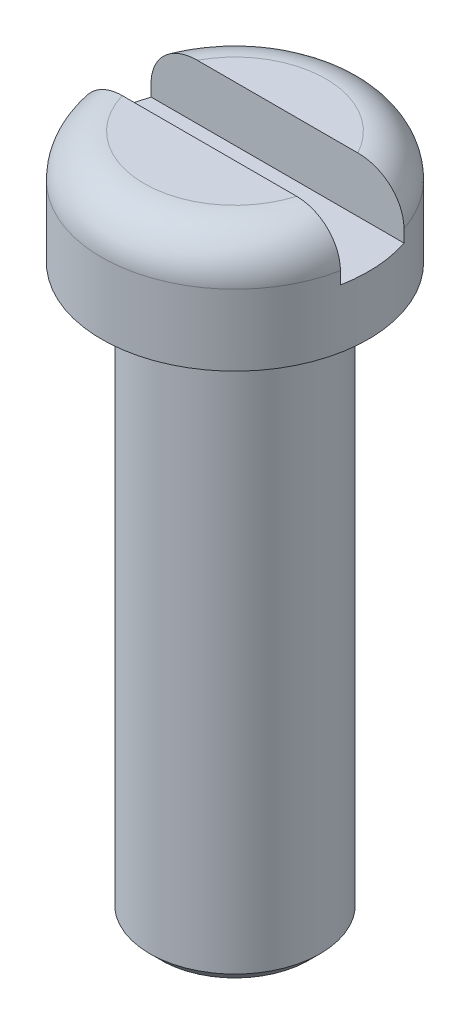
ISO-10303-21;
HEADER;
FILE_DESCRIPTION(('STEP AP214'),'2;1');
FILE_NAME('part.step','',(''),(''),'','','');
FILE_SCHEMA(('AUTOMOTIVE_DESIGN { 1 0 10303 214 1 1 1 1 }'));
ENDSEC;
DATA;
#1=APPLICATION_CONTEXT('core data for automotive mechanical design processes');
#2=APPLICATION_PROTOCOL_DEFINITION('international standard','automotive_design',2000,#1);
#3=PRODUCT_CONTEXT('',#1,'mechanical');
#4=PRODUCT('Part','Part','',(#3));
#5=PRODUCT_RELATED_PRODUCT_CATEGORY('part','',(#4));
#6=PRODUCT_DEFINITION_FORMATION('','',#4);
#7=PRODUCT_DEFINITION_CONTEXT('part definition',#1,'design');
#8=PRODUCT_DEFINITION('design','',#6,#7);
#9=PRODUCT_DEFINITION_SHAPE('','',#8);
#10=(LENGTH_UNIT() NAMED_UNIT(*) SI_UNIT(.MILLI.,.METRE.));
#11=(NAMED_UNIT(*) PLANE_ANGLE_UNIT() SI_UNIT($,.RADIAN.));
#12=(NAMED_UNIT(*) SI_UNIT($,.STERADIAN.) SOLID_ANGLE_UNIT());
#13=UNCERTAINTY_MEASURE_WITH_UNIT(LENGTH_MEASURE(1.E-05),#10,'distance_accuracy_value','');
#14=(GEOMETRIC_REPRESENTATION_CONTEXT(3) GLOBAL_UNCERTAINTY_ASSIGNED_CONTEXT((#13)) GLOBAL_UNIT_ASSIGNED_CONTEXT((#10,
#11,#12)) REPRESENTATION_CONTEXT('',''));
#15=CARTESIAN_POINT('',(0.,0.,0.));
#16=DIRECTION('',(0.,0.,1.));
#17=DIRECTION('',(1.,0.,0.));
#18=AXIS2_PLACEMENT_3D('',#15,#16,#17);
#19=CARTESIAN_POINT('',(0.,1.25,0.));
#20=DIRECTION('',(0.,-1.,0.));
#21=DIRECTION('',(0.,0.,-1.));
#22=AXIS2_PLACEMENT_3D('',#19,#20,#21);
#23=TOROIDAL_SURFACE('',#22,1.6,0.75);
#24=CARTESIAN_POINT('',(-2.28553482851223,1.42451434795185,0.45));
#25=CARTESIAN_POINT('',(-2.27563497721049,1.46510436659562,0.45));
#26=CARTESIAN_POINT('',(-2.26226961932218,1.50488564057234,0.45));
#27=CARTESIAN_POINT('',(-2.22900934301597,1.58166101221954,0.45));
#28=CARTESIAN_POINT('',(-2.20910525539727,1.61865110575377,0.45));
#29=CARTESIAN_POINT('',(-2.16340221076507,1.688734811653,0.45));
#30=CARTESIAN_POINT('',(-2.13760968409262,1.7218326152083,0.45));
#31=CARTESIAN_POINT('',(-2.08089854771931,1.78327395444593,0.45));
#32=CARTESIAN_POINT('',(-2.04998131459875,1.8116187627588,0.45));
#33=CARTESIAN_POINT('',(-1.98354712633862,1.86313175548619,0.45));
#34=CARTESIAN_POINT('',(-1.94798279873385,1.88623880168858,0.45));
#35=CARTESIAN_POINT('',(-1.87355215293915,1.92631716646786,0.45));
#36=CARTESIAN_POINT('',(-1.834685394656,1.94328766567875,0.45));
#37=CARTESIAN_POINT('',(-1.75374561495772,1.97107730583168,0.45));
#38=CARTESIAN_POINT('',(-1.71161732463744,1.98173530906363,0.45));
#39=CARTESIAN_POINT('',(-1.62619372797004,1.99608100770801,0.45));
#40=CARTESIAN_POINT('',(-1.58289824612188,1.99976764889773,0.45));
#41=CARTESIAN_POINT('',(-1.49478359888852,2.00021861402978,0.45));
#42=CARTESIAN_POINT('',(-1.44996324826013,1.99674047067321,0.45));
#43=CARTESIAN_POINT('',(-1.36147068102939,1.98261207833522,0.45));
#44=CARTESIAN_POINT('',(-1.31779867534794,1.97196052121529,0.45));
#45=CARTESIAN_POINT('',(-1.23097251811435,1.94331280274224,0.45));
#46=CARTESIAN_POINT('',(-1.18791036830293,1.9250376239129,0.45));
#47=CARTESIAN_POINT('',(-1.10532705926298,1.88171381982549,0.45));
#48=CARTESIAN_POINT('',(-1.065807123129,1.85666286685762,0.45));
#49=CARTESIAN_POINT('',(-0.990361216818817,1.79964229956113,0.45));
#50=CARTESIAN_POINT('',(-0.954565191809292,1.76750019362504,0.45));
#51=CARTESIAN_POINT('',(-0.889074064714299,1.69745867377017,0.45));
#52=CARTESIAN_POINT('',(-0.859380571387761,1.65955774627028,0.45));
#53=CARTESIAN_POINT('',(-0.808455159123776,1.58032464549682,0.45));
#54=CARTESIAN_POINT('',(-0.786957575885263,1.53916465957602,0.45));
#55=CARTESIAN_POINT('',(-0.7524539971328,1.45344723143556,0.45));
#56=CARTESIAN_POINT('',(-0.739431856450209,1.40889643048357,0.45));
#57=CARTESIAN_POINT('',(-0.724220278732988,1.3242662783112,0.45));
#58=CARTESIAN_POINT('',(-0.72079259687957,1.2844089994497,0.45));
#59=CARTESIAN_POINT('',(-0.721473966708011,1.20476460663683,0.45));
#60=CARTESIAN_POINT('',(-0.725580303909021,1.16497747258224,0.45));
#61=CARTESIAN_POINT('',(-0.740217649315046,1.09057613875983,0.45));
#62=CARTESIAN_POINT('',(-0.75009901128965,1.05583033576861,0.45));
#63=CARTESIAN_POINT('',(-0.77511433082508,0.988290678763211,0.45));
#64=CARTESIAN_POINT('',(-0.790250081237049,0.955497495482926,0.45));
#65=CARTESIAN_POINT('',(-0.826504693685406,0.889883278365814,0.45));
#66=CARTESIAN_POINT('',(-0.848009912778473,0.857276691942489,0.45));
#67=CARTESIAN_POINT('',(-0.895544651593592,0.795554039397172,0.45));
#68=CARTESIAN_POINT('',(-0.921576208891932,0.766439555296967,0.45));
#69=CARTESIAN_POINT('',(-0.981379053191539,0.708323149335471,0.45));
#70=CARTESIAN_POINT('',(-1.01572379180135,0.67990963902358,0.45));
#71=CARTESIAN_POINT('',(-1.08842078775867,0.628769965190417,0.45));
#72=CARTESIAN_POINT('',(-1.12677470323262,0.606046168133743,0.45));
#73=CARTESIAN_POINT('',(-1.20947777991774,0.56540070909462,0.45));
#74=CARTESIAN_POINT('',(-1.25406022286359,0.547951044644354,0.45));
#75=CARTESIAN_POINT('',(-1.34553721991615,0.520831419311235,0.45));
#76=CARTESIAN_POINT('',(-1.39243181008867,0.511161579821995,0.45));
#77=CARTESIAN_POINT('',(-1.48690070831531,0.500078578711665,0.45));
#78=CARTESIAN_POINT('',(-1.53446898137664,0.49861448059797,0.45));
#79=CARTESIAN_POINT('',(-1.62913167233977,0.504035849206408,0.45));
#80=CARTESIAN_POINT('',(-1.67622617915591,0.510919718588808,0.45));
#81=CARTESIAN_POINT('',(-1.76662479020754,0.532560224696492,0.45));
#82=CARTESIAN_POINT('',(-1.8100051023899,0.546998373611278,0.45));
#83=CARTESIAN_POINT('',(-1.89357188309888,0.583243927439645,0.45));
#84=CARTESIAN_POINT('',(-1.93375906010376,0.605049691989135,0.45));
#85=CARTESIAN_POINT('',(-2.00814703297934,0.654476470286428,0.45));
#86=CARTESIAN_POINT('',(-2.04251952105686,0.681839234410962,0.45));
#87=CARTESIAN_POINT('',(-2.10601011357969,0.742099539231574,0.45));
#88=CARTESIAN_POINT('',(-2.13512935121136,0.774995883305287,0.45));
#89=CARTESIAN_POINT('',(-2.18642771276026,0.844362864124189,0.45));
#90=CARTESIAN_POINT('',(-2.20878131714578,0.880704563019684,0.45));
#91=CARTESIAN_POINT('',(-2.24694908007151,0.956687997531197,0.45));
#92=CARTESIAN_POINT('',(-2.26276208545571,0.99633031359167,0.45));
#93=CARTESIAN_POINT('',(-2.28712944377491,1.07704210984603,0.45));
#94=CARTESIAN_POINT('',(-2.29580296043559,1.11807573253051,0.45));
#95=CARTESIAN_POINT('',(-2.30606148556497,1.20098020552567,0.45));
#96=CARTESIAN_POINT('',(-2.30765659204865,1.24284977750379,0.45));
#97=CARTESIAN_POINT('',(-2.30459661686495,1.3081087331017,0.45));
#98=CARTESIAN_POINT('',(-2.3023526959748,1.3316357035273,0.45));
#99=CARTESIAN_POINT('',(-2.29561991405372,1.37836604125377,0.45));
#100=CARTESIAN_POINT('',(-2.29113106803936,1.40156941071817,0.45));
#101=CARTESIAN_POINT('',(-2.28553482851223,1.42451434795185,0.45));
#102=B_SPLINE_CURVE_WITH_KNOTS('',3,(#24,#25,#26,#27,#28,#29,#30,#31,#32,#33,#34,#35,#36,#37,
#38,#39,#40,#41,#42,#43,#44,#45,#46,#47,#48,#49,#50,#51,#52,#53,#54,#55,#56,#57,#58,#59,#60,#61,
#62,#63,#64,#65,#66,#67,#68,#69,#70,#71,#72,#73,#74,#75,#76,#77,#78,#79,#80,#81,#82,#83,#84,#85,
#86,#87,#88,#89,#90,#91,#92,#93,#94,#95,#96,#97,#98,#99,#100,#101),.UNSPECIFIED.,.T.,.F.,(4,2,2,
2,2,2,2,2,2,2,2,2,2,2,2,2,2,2,2,2,2,2,2,2,2,2,2,2,2,2,2,2,2,2,2,2,2,2,4),(0.,0.125251686644736,
0.250679767716014,0.375971527473979,0.501229686186662,0.627882208065345,0.754551634644082,
0.884328867811485,1.01412572457166,1.14838717649589,1.2826731188727,1.42237759707704,
1.56213012963054,1.70575547595153,1.84941863658013,1.98792058849521,2.12615792490952,
2.24548381514644,2.36476672112278,2.47268062626887,2.58063138899464,2.69735771200316,
2.81413671721375,2.94729314530645,3.08050486414441,3.22344672331681,3.36639081285971,
3.50844659713626,3.65047520407297,3.78694815416916,3.92339073922172,4.05454315648616,
4.18566724875391,4.31304587499636,4.44044694947047,4.56567582459708,4.69072599145432,
4.76152939111185,4.83233231716362),.UNSPECIFIED.);
#103=CARTESIAN_POINT('',(-2.30651251893416,1.25,0.45));
#104=VERTEX_POINT('',#103);
#105=CARTESIAN_POINT('',(-1.53541525327841,2.,0.45));
#106=VERTEX_POINT('',#105);
#107=EDGE_CURVE('E140',#104,#106,#102,.T.);
#108=ORIENTED_EDGE('',*,*,#107,.F.);
#109=CARTESIAN_POINT('',(0.,1.25,0.));
#110=DIRECTION('',(0.,-1.,0.));
#111=DIRECTION('',(0.,0.,-1.));
#112=AXIS2_PLACEMENT_3D('',#109,#110,#111);
#113=CIRCLE('',#112,2.35);
#114=CARTESIAN_POINT('',(2.30651251893416,1.25,0.45));
#115=VERTEX_POINT('',#114);
#116=EDGE_CURVE('E154',#115,#104,#113,.T.);
#117=ORIENTED_EDGE('',*,*,#116,.F.);
#118=CARTESIAN_POINT('',(0.725060138864897,1.32084498514233,0.45));
#119=CARTESIAN_POINT('',(0.72949295304882,1.36050445561477,0.45));
#120=CARTESIAN_POINT('',(0.737649232041033,1.39979365734048,0.45));
#121=CARTESIAN_POINT('',(0.760768579772106,1.47635787764432,0.45));
#122=CARTESIAN_POINT('',(0.77574819499438,1.5136277521119,0.45));
#123=CARTESIAN_POINT('',(0.811463154112292,1.58497997487983,0.45));
#124=CARTESIAN_POINT('',(0.8321616460654,1.61908092366698,0.45));
#125=CARTESIAN_POINT('',(0.878452932115009,1.68374099105789,0.45));
#126=CARTESIAN_POINT('',(0.904044834784215,1.71430075312982,0.45));
#127=CARTESIAN_POINT('',(0.962171602153618,1.77433524786628,0.45));
#128=CARTESIAN_POINT('',(0.995148076051748,1.80338269689208,0.45));
#129=CARTESIAN_POINT('',(1.06518136927172,1.85606172115489,0.45));
#130=CARTESIAN_POINT('',(1.10223988321557,1.87969103446217,0.45));
#131=CARTESIAN_POINT('',(1.18282888078948,1.92275108367119,0.45));
#132=CARTESIAN_POINT('',(1.22664168809807,1.94165629950541,0.45));
#133=CARTESIAN_POINT('',(1.31682530181784,1.97184990225881,0.45));
#134=CARTESIAN_POINT('',(1.36319634084451,1.98313759529119,0.45));
#135=CARTESIAN_POINT('',(1.45719643707157,1.99762039074231,0.45));
#136=CARTESIAN_POINT('',(1.50482550852513,2.00081540143336,0.45));
#137=CARTESIAN_POINT('',(1.5999126021487,1.99883132503972,0.45));
#138=CARTESIAN_POINT('',(1.64737065622607,1.99365389077762,0.45));
#139=CARTESIAN_POINT('',(1.73884330915336,1.97526518204962,0.45));
#140=CARTESIAN_POINT('',(1.78292027031656,1.96236440707172,0.45));
#141=CARTESIAN_POINT('',(1.86813586670785,1.92904172996366,0.45));
#142=CARTESIAN_POINT('',(1.90927515168987,1.90862149717411,0.45));
#143=CARTESIAN_POINT('',(1.98571857761958,1.86173410785921,0.45));
#144=CARTESIAN_POINT('',(2.02118921690536,1.83553825218989,0.45));
#145=CARTESIAN_POINT('',(2.0870560569773,1.77739628705813,0.45));
#146=CARTESIAN_POINT('',(2.11745316444792,1.74545120715754,0.45));
#147=CARTESIAN_POINT('',(2.17137457668852,1.6777529462465,0.45));
#148=CARTESIAN_POINT('',(2.19507575728465,1.64214055672036,0.45));
#149=CARTESIAN_POINT('',(2.23602968994365,1.56738283464316,0.45));
#150=CARTESIAN_POINT('',(2.25328318352787,1.52823790899746,0.45));
#151=CARTESIAN_POINT('',(2.28053682701034,1.44831678287951,0.45));
#152=CARTESIAN_POINT('',(2.29066627950297,1.40758463468038,0.45));
#153=CARTESIAN_POINT('',(2.30387484874252,1.32499327741791,0.45));
#154=CARTESIAN_POINT('',(2.30695440617521,1.28313413896772,0.45));
#155=CARTESIAN_POINT('',(2.30597261761384,1.19987390974504,0.45));
#156=CARTESIAN_POINT('',(2.30197454492275,1.15847205652076,0.45));
#157=CARTESIAN_POINT('',(2.28708273178782,1.07692890530086,0.45));
#158=CARTESIAN_POINT('',(2.27618911248516,1.03678758517315,0.45));
#159=CARTESIAN_POINT('',(2.2478383065195,0.958898048370936,0.45));
#160=CARTESIAN_POINT('',(2.23038144062707,0.921149714847508,0.45));
#161=CARTESIAN_POINT('',(2.18942965120413,0.849086671497346,0.45));
#162=CARTESIAN_POINT('',(2.16593458944364,0.814772040301962,0.45));
#163=CARTESIAN_POINT('',(2.11337533221624,0.750219077099048,0.45));
#164=CARTESIAN_POINT('',(2.08426489230305,0.720018418327841,0.45));
#165=CARTESIAN_POINT('',(2.02146519170529,0.664831859307761,0.45));
#166=CARTESIAN_POINT('',(1.98777563163892,0.639846300291932,0.45));
#167=CARTESIAN_POINT('',(1.91614787463506,0.595303984195625,0.45));
#168=CARTESIAN_POINT('',(1.87814479624395,0.575851631049531,0.45));
#169=CARTESIAN_POINT('',(1.7994768501942,0.543411988119089,0.45));
#170=CARTESIAN_POINT('',(1.75881170482842,0.530425374061365,0.45));
#171=CARTESIAN_POINT('',(1.67477998264973,0.510879387736901,0.45));
#172=CARTESIAN_POINT('',(1.63136979388398,0.5045077646278,0.45));
#173=CARTESIAN_POINT('',(1.54409317676112,0.498865466676838,0.45));
#174=CARTESIAN_POINT('',(1.50022666752201,0.499596072878002,0.45));
#175=CARTESIAN_POINT('',(1.41155090776663,0.508155372493193,0.45));
#176=CARTESIAN_POINT('',(1.36676700299506,0.516246226038792,0.45));
#177=CARTESIAN_POINT('',(1.27909032306256,0.539536759648482,0.45));
#178=CARTESIAN_POINT('',(1.23619787992659,0.554737682412954,0.45));
#179=CARTESIAN_POINT('',(1.15173246025417,0.592497114526633,0.45));
#180=CARTESIAN_POINT('',(1.11027882641351,0.615322924418275,0.45));
#181=CARTESIAN_POINT('',(1.03168198976037,0.667508140348306,0.45));
#182=CARTESIAN_POINT('',(0.99454081972697,0.69687060872002,0.45));
#183=CARTESIAN_POINT('',(0.925199762545152,0.761922498996724,0.45));
#184=CARTESIAN_POINT('',(0.893082309970407,0.797700181383415,0.45));
#185=CARTESIAN_POINT('',(0.835796576187711,0.874489856094101,0.45));
#186=CARTESIAN_POINT('',(0.810627550212302,0.915501286748945,0.45));
#187=CARTESIAN_POINT('',(0.770235198982757,0.998728454461087,0.45));
#188=CARTESIAN_POINT('',(0.754447996973056,1.04066852942322,0.45));
#189=CARTESIAN_POINT('',(0.731585839358426,1.12679484340161,0.45));
#190=CARTESIAN_POINT('',(0.724481027173068,1.17097283772138,0.45));
#191=CARTESIAN_POINT('',(0.721092792923136,1.23292685900574,0.45));
#192=CARTESIAN_POINT('',(0.720866612330428,1.25054978987935,0.45));
#193=CARTESIAN_POINT('',(0.721871799005589,1.2857541977237,0.45));
#194=CARTESIAN_POINT('',(0.723103090285785,1.30333567680771,0.45));
#195=CARTESIAN_POINT('',(0.725060138864897,1.32084498514233,0.45));
#196=B_SPLINE_CURVE_WITH_KNOTS('',3,(#118,#119,#120,#121,#122,#123,#124,#125,#126,#127,#128,
#129,#130,#131,#132,#133,#134,#135,#136,#137,#138,#139,#140,#141,#142,#143,#144,#145,#146,#147,
#148,#149,#150,#151,#152,#153,#154,#155,#156,#157,#158,#159,#160,#161,#162,#163,#164,#165,#166,
#167,#168,#169,#170,#171,#172,#173,#174,#175,#176,#177,#178,#179,#180,#181,#182,#183,#184,#185,
#186,#187,#188,#189,#190,#191,#192,#193,#194,#195),.UNSPECIFIED.,.T.,.F.,(4,2,2,2,2,2,2,2,2,2,2,
2,2,2,2,2,2,2,2,2,2,2,2,2,2,2,2,2,2,2,2,2,2,2,2,2,2,2,4),(0.,0.119643695459646,
0.239579082419671,0.358758950871889,0.477917129106196,0.609207721478125,0.740553024845102,
0.883029388176472,1.02551872805266,1.16800968298775,1.31047251190715,1.44756000952266,
1.58461709166132,1.71624992379042,1.84785920673657,1.97557094554748,2.10326799224517,
2.22858293091901,2.35389003599857,2.47808255869796,2.6022728996396,2.72645717172058,
2.85064428695519,2.97590151757536,3.10116694142644,3.22865921154934,3.35616480294085,
3.48719783972159,3.61825451162654,3.75417016186881,3.89010957637765,4.03142727899051,
4.17281132682373,4.31631516796085,4.45980362165429,4.59344774821411,4.72663100078973,
4.77945539682739,4.83227703890033),.UNSPECIFIED.);
#197=CARTESIAN_POINT('',(1.53541525327841,2.,0.45));
#198=VERTEX_POINT('',#197);
#199=EDGE_CURVE('E135',#198,#115,#196,.T.);
#200=ORIENTED_EDGE('',*,*,#199,.F.);
#201=CARTESIAN_POINT('',(0.,2.,0.));
#202=DIRECTION('',(0.,-1.,0.));
#203=DIRECTION('',(0.,0.,-1.));
#204=AXIS2_PLACEMENT_3D('',#201,#202,#203);
#205=CIRCLE('',#204,1.6);
#206=EDGE_CURVE('E151',#198,#106,#205,.T.);
#207=ORIENTED_EDGE('',*,*,#206,.T.);
#208=EDGE_LOOP('',(#108,#117,#200,#207));
#209=FACE_BOUND('',#208,.T.);
#210=ADVANCED_FACE('F32',(#209),#23,.T.);
#211=CARTESIAN_POINT('',(0.,2.,-1.6));
#212=DIRECTION('',(0.,1.,0.));
#213=DIRECTION('',(0.,0.,1.));
#214=AXIS2_PLACEMENT_3D('',#211,#212,#213);
#215=PLANE('',#214);
#216=DIRECTION('',(1.,0.,0.));
#217=VECTOR('',#216,1.);
#218=CARTESIAN_POINT('',(0.,2.,0.45));
#219=LINE('',#218,#217);
#220=EDGE_CURVE('E163',#106,#198,#219,.T.);
#221=ORIENTED_EDGE('',*,*,#220,.F.);
#222=ORIENTED_EDGE('',*,*,#206,.F.);
#223=EDGE_LOOP('',(#221,#222));
#224=FACE_BOUND('',#223,.T.);
#225=ADVANCED_FACE('F174',(#224),#215,.T.);
#226=CARTESIAN_POINT('',(0.,-26.35,0.));
#227=DIRECTION('',(0.,-1.,0.));
#228=DIRECTION('',(0.,0.,-1.));
#229=AXIS2_PLACEMENT_3D('',#226,#227,#228);
#230=CYLINDRICAL_SURFACE('',#229,1.5);
#231=CARTESIAN_POINT('',(0.,-9.79999999999999,0.));
#232=DIRECTION('',(0.,-1.,0.));
#233=DIRECTION('',(0.,0.,-1.));
#234=AXIS2_PLACEMENT_3D('',#231,#232,#233);
#235=CIRCLE('',#234,1.5);
#236=CARTESIAN_POINT('',(0.,-9.79999999999999,-1.5));
#237=VERTEX_POINT('',#236);
#238=EDGE_CURVE('E11',#237,#237,#235,.F.);
#239=ORIENTED_EDGE('',*,*,#238,.T.);
#240=EDGE_LOOP('',(#239));
#241=FACE_BOUND('',#240,.T.);
#242=CARTESIAN_POINT('',(0.,0.,0.));
#243=DIRECTION('',(0.,-1.,0.));
#244=DIRECTION('',(0.,0.,-1.));
#245=AXIS2_PLACEMENT_3D('',#242,#243,#244);
#246=CIRCLE('',#245,1.5);
#247=CARTESIAN_POINT('',(0.,0.,-1.5));
#248=VERTEX_POINT('',#247);
#249=EDGE_CURVE('E158',#248,#248,#246,.T.);
#250=ORIENTED_EDGE('',*,*,#249,.T.);
#251=EDGE_LOOP('',(#250));
#252=FACE_BOUND('',#251,.T.);
#253=ADVANCED_FACE('F179',(#241,#252),#230,.T.);
#254=CARTESIAN_POINT('',(0.,0.,-1.5));
#255=DIRECTION('',(0.,-1.,0.));
#256=DIRECTION('',(0.,0.,-1.));
#257=AXIS2_PLACEMENT_3D('',#254,#255,#256);
#258=PLANE('',#257);
#259=CARTESIAN_POINT('',(0.,0.,0.));
#260=DIRECTION('',(0.,-1.,0.));
#261=DIRECTION('',(0.,0.,-1.));
#262=AXIS2_PLACEMENT_3D('',#259,#260,#261);
#263=CIRCLE('',#262,2.35);
#264=CARTESIAN_POINT('',(0.,0.,-2.35));
#265=VERTEX_POINT('',#264);
#266=EDGE_CURVE('E155',#265,#265,#263,.T.);
#267=ORIENTED_EDGE('',*,*,#266,.T.);
#268=EDGE_LOOP('',(#267));
#269=FACE_BOUND('',#268,.T.);
#270=ORIENTED_EDGE('',*,*,#249,.F.);
#271=EDGE_LOOP('',(#270));
#272=FACE_BOUND('',#271,.T.);
#273=ADVANCED_FACE('F189',(#269,#272),#258,.T.);
#274=CARTESIAN_POINT('',(0.,-26.35,0.));
#275=DIRECTION('',(0.,-1.,0.));
#276=DIRECTION('',(0.,0.,-1.));
#277=AXIS2_PLACEMENT_3D('',#274,#275,#276);
#278=CYLINDRICAL_SURFACE('',#277,2.35);
#279=DIRECTION('',(0.,-1.,0.));
#280=VECTOR('',#279,1.);
#281=CARTESIAN_POINT('',(-2.22710574513201,-26.35,-0.75));
#282=LINE('',#281,#280);
#283=CARTESIAN_POINT('',(-2.22710574514071,1.24999999999655,-0.75));
#284=VERTEX_POINT('',#283);
#285=CARTESIAN_POINT('',(-2.22710574513201,1.03167946991789,-0.75));
#286=VERTEX_POINT('',#285);
#287=EDGE_CURVE('E90',#284,#286,#282,.T.);
#288=ORIENTED_EDGE('',*,*,#287,.F.);
#289=CARTESIAN_POINT('',(2.22710574513201,1.25,-0.75));
#290=VERTEX_POINT('',#289);
#291=EDGE_CURVE('E152',#284,#290,#113,.T.);
#292=ORIENTED_EDGE('',*,*,#291,.T.);
#293=DIRECTION('',(0.,-1.,0.));
#294=VECTOR('',#293,1.);
#295=CARTESIAN_POINT('',(2.22710574513201,-26.35,-0.75));
#296=LINE('',#295,#294);
#297=CARTESIAN_POINT('',(2.22710574513201,1.03167946991789,-0.75));
#298=VERTEX_POINT('',#297);
#299=EDGE_CURVE('E104',#298,#290,#296,.F.);
#300=ORIENTED_EDGE('',*,*,#299,.F.);
#301=CARTESIAN_POINT('',(0.,1.03167946991789,0.));
#302=DIRECTION('',(0.,-1.,0.));
#303=DIRECTION('',(0.,0.,-1.));
#304=AXIS2_PLACEMENT_3D('',#301,#302,#303);
#305=CIRCLE('',#304,2.35);
#306=CARTESIAN_POINT('',(2.30651251893416,1.03167946991789,0.45));
#307=VERTEX_POINT('',#306);
#308=EDGE_CURVE('E96',#307,#298,#305,.F.);
#309=ORIENTED_EDGE('',*,*,#308,.F.);
#310=DIRECTION('',(0.,-1.,0.));
#311=VECTOR('',#310,1.);
#312=CARTESIAN_POINT('',(2.30651251893416,-26.35,0.449999999999999));
#313=LINE('',#312,#311);
#314=EDGE_CURVE('E144',#115,#307,#313,.T.);
#315=ORIENTED_EDGE('',*,*,#314,.F.);
#316=ORIENTED_EDGE('',*,*,#116,.T.);
#317=DIRECTION('',(0.,-1.,0.));
#318=VECTOR('',#317,1.);
#319=CARTESIAN_POINT('',(-2.30651251893416,-26.35,0.449999999999999));
#320=LINE('',#319,#318);
#321=CARTESIAN_POINT('',(-2.30651251893416,1.03167946991789,0.45));
#322=VERTEX_POINT('',#321);
#323=EDGE_CURVE('E55',#322,#104,#320,.F.);
#324=ORIENTED_EDGE('',*,*,#323,.F.);
#325=EDGE_CURVE('E85',#286,#322,#305,.F.);
#326=ORIENTED_EDGE('',*,*,#325,.F.);
#327=EDGE_LOOP('',(#288,#292,#300,#309,#315,#316,#324,#326));
#328=FACE_BOUND('',#327,.T.);
#329=ORIENTED_EDGE('',*,*,#266,.F.);
#330=EDGE_LOOP('',(#329));
#331=FACE_BOUND('',#330,.T.);
#332=ADVANCED_FACE('F87',(#328,#331),#278,.T.);
#333=CARTESIAN_POINT('',(-2.2095921612026,1.40687973755769,-0.75));
#334=CARTESIAN_POINT('',(-2.21841081860084,1.36783118405451,-0.75));
#335=CARTESIAN_POINT('',(-2.22394633208883,1.3280022672924,-0.75));
#336=CARTESIAN_POINT('',(-2.2282352711434,1.24794096939178,-0.75));
#337=CARTESIAN_POINT('',(-2.22697882766541,1.2077080859804,-0.75));
#338=CARTESIAN_POINT('',(-2.2177156292657,1.12805510442241,-0.75));
#339=CARTESIAN_POINT('',(-2.20971405384772,1.08863440639616,-0.75));
#340=CARTESIAN_POINT('',(-2.18724295937638,1.01169960984886,-0.75));
#341=CARTESIAN_POINT('',(-2.17277528777568,0.974184970147886,-0.75));
#342=CARTESIAN_POINT('',(-2.13775564658932,0.901851546267111,-0.75));
#343=CARTESIAN_POINT('',(-2.11716933370377,0.86704941744244,-0.75));
#344=CARTESIAN_POINT('',(-2.07061194944599,0.801260705678921,-0.75));
#345=CARTESIAN_POINT('',(-2.04464014414215,0.770274643709674,-0.75));
#346=CARTESIAN_POINT('',(-1.98722386555728,0.711921590007932,-0.75));
#347=CARTESIAN_POINT('',(-1.95563335619334,0.684698500690627,-0.75));
#348=CARTESIAN_POINT('',(-1.88854143708776,0.635610803457483,-0.75));
#349=CARTESIAN_POINT('',(-1.85303928248836,0.613747218666576,-0.75));
#350=CARTESIAN_POINT('',(-1.77701251570502,0.574622281147074,-0.75));
#351=CARTESIAN_POINT('',(-1.73631707194533,0.557693551377954,-0.75));
#352=CARTESIAN_POINT('',(-1.6528123859334,0.530313774758865,-0.75));
#353=CARTESIAN_POINT('',(-1.61000250741635,0.519864690710627,-0.75));
#354=CARTESIAN_POINT('',(-1.51959078074189,0.504722560230901,-0.75));
#355=CARTESIAN_POINT('',(-1.47189357622672,0.500602199471842,-0.75));
#356=CARTESIAN_POINT('',(-1.37643371936228,0.499520128484148,-0.75));
#357=CARTESIAN_POINT('',(-1.32867105037975,0.502560829954616,-0.75));
#358=CARTESIAN_POINT('',(-1.22833274605307,0.516032934479535,-0.75));
#359=CARTESIAN_POINT('',(-1.17587184539081,0.527311928037582,-0.75));
#360=CARTESIAN_POINT('',(-1.07311999070502,0.557303451933849,-0.75));
#361=CARTESIAN_POINT('',(-1.0228306738324,0.576021485699698,-0.75));
#362=CARTESIAN_POINT('',(-0.91749254619779,0.623472252984485,-0.75));
#363=CARTESIAN_POINT('',(-0.8629478025606,0.653320269365187,-0.75));
#364=CARTESIAN_POINT('',(-0.758738284988483,0.720623828036569,-0.75));
#365=CARTESIAN_POINT('',(-0.709075433064299,0.758082348940097,-0.75));
#366=CARTESIAN_POINT('',(-0.630107779719684,0.827566462425174,-0.75));
#367=CARTESIAN_POINT('',(-0.599200605866218,0.857787487308149,-0.75));
#368=CARTESIAN_POINT('',(-0.541279362280136,0.921789758705513,-0.75));
#369=CARTESIAN_POINT('',(-0.514259905852751,0.955565964618754,-0.75));
#370=CARTESIAN_POINT('',(-0.475257231349994,1.01367297893879,-0.75));
#371=CARTESIAN_POINT('',(-0.461445055858665,1.03676575724776,-0.75));
#372=CARTESIAN_POINT('',(-0.437146963253811,1.08464933291446,-0.75));
#373=CARTESIAN_POINT('',(-0.426654081746909,1.10943644053009,-0.75));
#374=CARTESIAN_POINT('',(-0.412156813413841,1.15497900295492,-0.75));
#375=CARTESIAN_POINT('',(-0.407236630163653,1.17543548785297,-0.75));
#376=CARTESIAN_POINT('',(-0.400955697588497,1.21687669408379,-0.75));
#377=CARTESIAN_POINT('',(-0.399588622050238,1.23786040932142,-0.75));
#378=CARTESIAN_POINT('',(-0.400631060904548,1.27975107848125,-0.75));
#379=CARTESIAN_POINT('',(-0.403044465735121,1.30065793110625,-0.75));
#380=CARTESIAN_POINT('',(-0.411264714411017,1.34180374406836,-0.75));
#381=CARTESIAN_POINT('',(-0.417078203228564,1.36204131433319,-0.75));
#382=CARTESIAN_POINT('',(-0.435232772694134,1.41214080171185,-0.75));
#383=CARTESIAN_POINT('',(-0.449402948871285,1.4413260541767,-0.75));
#384=CARTESIAN_POINT('',(-0.481858125216715,1.49732932047517,-0.75));
#385=CARTESIAN_POINT('',(-0.500158728979317,1.5241378062427,-0.75));
#386=CARTESIAN_POINT('',(-0.538024132631374,1.57358070003482,-0.75));
#387=CARTESIAN_POINT('',(-0.557379798279743,1.59637758383864,-0.75));
#388=CARTESIAN_POINT('',(-0.597938740009237,1.64027470747394,-0.75));
#389=CARTESIAN_POINT('',(-0.619143434132315,1.66137362083945,-0.75));
#390=CARTESIAN_POINT('',(-0.685040277313454,1.7222254497362,-0.75));
#391=CARTESIAN_POINT('',(-0.732017211106712,1.75953597241702,-0.75));
#392=CARTESIAN_POINT('',(-0.833838729939613,1.8294003105734,-0.75));
#393=CARTESIAN_POINT('',(-0.888993958118245,1.86149926599271,-0.75));
#394=CARTESIAN_POINT('',(-1.00360882327112,1.91665725631007,-0.75));
#395=CARTESIAN_POINT('',(-1.06306156653872,1.93973040442862,-0.75));
#396=CARTESIAN_POINT('',(-1.17814539809819,1.97337828641699,-0.75));
#397=CARTESIAN_POINT('',(-1.23344682990683,1.98507249739429,-0.75));
#398=CARTESIAN_POINT('',(-1.3452753666375,1.99918537866631,-0.75));
#399=CARTESIAN_POINT('',(-1.40180258945596,2.00160315273955,-0.75));
#400=CARTESIAN_POINT('',(-1.51480383378189,1.9962767177191,-0.75));
#401=CARTESIAN_POINT('',(-1.57127492217861,1.98846382406044,-0.75));
#402=CARTESIAN_POINT('',(-1.68165366403018,1.96204936356573,-0.75));
#403=CARTESIAN_POINT('',(-1.73556330230145,1.94345630259749,-0.75));
#404=CARTESIAN_POINT('',(-1.83189585776212,1.89861996964602,-0.75));
#405=CARTESIAN_POINT('',(-1.87490894644045,1.87364325826643,-0.75));
#406=CARTESIAN_POINT('',(-1.95547919119261,1.81601957609928,-0.75));
#407=CARTESIAN_POINT('',(-1.99303833144298,1.78337540614592,-0.75));
#408=CARTESIAN_POINT('',(-2.05751733681711,1.71513539147413,-0.75));
#409=CARTESIAN_POINT('',(-2.08513702334644,1.68019814436889,-0.75));
#410=CARTESIAN_POINT('',(-2.13360619292425,1.60596611796789,-0.75));
#411=CARTESIAN_POINT('',(-2.15447053255215,1.56668115936001,-0.75));
#412=CARTESIAN_POINT('',(-2.17960499636576,1.50663308285179,-0.75));
#413=CARTESIAN_POINT('',(-2.18681678359355,1.48705695055081,-0.75));
#414=CARTESIAN_POINT('',(-2.19951342723082,1.44735105073809,-0.75));
#415=CARTESIAN_POINT('',(-2.20499826337914,1.42722127673387,-0.75));
#416=CARTESIAN_POINT('',(-2.2095921612026,1.40687973755769,-0.75));
#417=B_SPLINE_CURVE_WITH_KNOTS('',3,(#333,#334,#335,#336,#337,#338,#339,#340,#341,#342,#343,
#344,#345,#346,#347,#348,#349,#350,#351,#352,#353,#354,#355,#356,#357,#358,#359,#360,#361,#362,
#363,#364,#365,#366,#367,#368,#369,#370,#371,#372,#373,#374,#375,#376,#377,#378,#379,#380,#381,
#382,#383,#384,#385,#386,#387,#388,#389,#390,#391,#392,#393,#394,#395,#396,#397,#398,#399,#400,
#401,#402,#403,#404,#405,#406,#407,#408,#409,#410,#411,#412,#413,#414,#415,#416),.UNSPECIFIED.,
.T.,.F.,(4,2,2,2,2,2,2,2,2,2,2,2,2,2,2,2,2,2,2,2,2,2,2,2,2,2,2,2,2,2,2,2,2,2,2,2,2,2,2,2,2,4),
(0.,0.120018257407675,0.240210954027629,0.360311440141212,0.480377633807849,0.601130899727588,
0.721900632656587,0.846456296170918,0.971035718772655,1.10270318681739,1.23441051985843,
1.37745139655808,1.52054045338413,1.68089673206303,1.84137186436371,2.02721135829376,
2.21312372701613,2.34257869139697,2.47185252333256,2.55240330279774,2.63278393571109,
2.69564292274286,2.75838991411681,2.82120151995051,2.88413629412959,2.98091401774405,
3.07806364848888,3.16765482163468,3.25731531799156,3.43662671931101,3.62736899018325,
3.81781180281684,3.98668807207809,4.15558065651845,4.32561295144468,4.49551126813264,
4.64389987379044,4.79223435887061,4.92516423740541,5.05779975450089,5.12032005869946,
5.18284109637925),.UNSPECIFIED.);
#418=CARTESIAN_POINT('',(-1.41332940251026,2.,-0.75));
#419=VERTEX_POINT('',#418);
#420=EDGE_CURVE('E103',#419,#284,#417,.T.);
#421=ORIENTED_EDGE('',*,*,#420,.F.);
#422=CARTESIAN_POINT('',(1.41332940251026,2.,-0.75));
#423=VERTEX_POINT('',#422);
#424=EDGE_CURVE('E148',#419,#423,#205,.T.);
#425=ORIENTED_EDGE('',*,*,#424,.T.);
#426=CARTESIAN_POINT('',(0.419224334372551,1.36720238658967,-0.75));
#427=CARTESIAN_POINT('',(0.412727789888853,1.3471578659079,-0.75));
#428=CARTESIAN_POINT('',(0.40767210008708,1.3266359677278,-0.75));
#429=CARTESIAN_POINT('',(0.401136046562363,1.2850371091079,-0.75));
#430=CARTESIAN_POINT('',(0.399649784559209,1.26396112262438,-0.75));
#431=CARTESIAN_POINT('',(0.400492531441597,1.22186398260965,-0.75));
#432=CARTESIAN_POINT('',(0.40282613216073,1.20084292554139,-0.75));
#433=CARTESIAN_POINT('',(0.410934636563452,1.15946431490625,-0.75));
#434=CARTESIAN_POINT('',(0.416716413217251,1.13910817236496,-0.75));
#435=CARTESIAN_POINT('',(0.434738963810067,1.0890002878708,-0.75));
#436=CARTESIAN_POINT('',(0.448776517708915,1.05990870746286,-0.75));
#437=CARTESIAN_POINT('',(0.480957825765008,1.00407636267789,-0.75));
#438=CARTESIAN_POINT('',(0.499116943631237,0.977344927598129,-0.75));
#439=CARTESIAN_POINT('',(0.536715601309972,0.928022445901346,-0.75));
#440=CARTESIAN_POINT('',(0.555947861148744,0.905271075780793,-0.75));
#441=CARTESIAN_POINT('',(0.5962566322346,0.861454470553506,-0.75));
#442=CARTESIAN_POINT('',(0.617334563087311,0.840390557633165,-0.75));
#443=CARTESIAN_POINT('',(0.68284555509195,0.779624447910663,-0.75));
#444=CARTESIAN_POINT('',(0.729556515794641,0.742347005432872,-0.75));
#445=CARTESIAN_POINT('',(0.830863484780822,0.672445794344835,-0.75));
#446=CARTESIAN_POINT('',(0.885774403560953,0.640280635182885,-0.75));
#447=CARTESIAN_POINT('',(0.999897486647731,0.584912652445029,-0.75));
#448=CARTESIAN_POINT('',(1.05910279584901,0.561695903055798,-0.75));
#449=CARTESIAN_POINT('',(1.17399104803582,0.527613837682685,-0.75));
#450=CARTESIAN_POINT('',(1.22935394292704,0.515677612871662,-0.75));
#451=CARTESIAN_POINT('',(1.34134504033413,0.501093410187834,-0.75));
#452=CARTESIAN_POINT('',(1.39797337702116,0.498446421973534,-0.75));
#453=CARTESIAN_POINT('',(1.51121702075396,0.503337333727619,-0.75));
#454=CARTESIAN_POINT('',(1.56782966106347,0.510944084646043,-0.75));
#455=CARTESIAN_POINT('',(1.67852942789287,0.536984518296947,-0.75));
#456=CARTESIAN_POINT('',(1.73261839718144,0.555410163229956,-0.75));
#457=CARTESIAN_POINT('',(1.82929007381465,0.599971476595585,-0.75));
#458=CARTESIAN_POINT('',(1.87246168889465,0.624830859501291,-0.75));
#459=CARTESIAN_POINT('',(1.95334781298712,0.682244539681937,-0.75));
#460=CARTESIAN_POINT('',(1.99106635101364,0.714793108468049,-0.75));
#461=CARTESIAN_POINT('',(2.05582167367319,0.782853472023323,-0.75));
#462=CARTESIAN_POINT('',(2.08356411548849,0.817695564027583,-0.75));
#463=CARTESIAN_POINT('',(2.1323334339036,0.891800051390474,-0.75));
#464=CARTESIAN_POINT('',(2.15336332816179,0.931060449710815,-0.75));
#465=CARTESIAN_POINT('',(2.18678529063598,1.0101780377022,-0.75));
#466=CARTESIAN_POINT('',(2.19963938762448,1.0498405862699,-0.75));
#467=CARTESIAN_POINT('',(2.21826677247829,1.13079412624036,-0.75));
#468=CARTESIAN_POINT('',(2.22404159985142,1.17208476157124,-0.75));
#469=CARTESIAN_POINT('',(2.22823421359363,1.25374321464855,-0.75));
#470=CARTESIAN_POINT('',(2.2268754707499,1.29409973592975,-0.75));
#471=CARTESIAN_POINT('',(2.2173643901439,1.37400128281395,-0.75));
#472=CARTESIAN_POINT('',(2.20921253349758,1.41354636568308,-0.75));
#473=CARTESIAN_POINT('',(2.18645151392578,1.49052024108681,-0.75));
#474=CARTESIAN_POINT('',(2.17187360160902,1.52795829868661,-0.75));
#475=CARTESIAN_POINT('',(2.13675447249212,1.59991900166265,-0.75));
#476=CARTESIAN_POINT('',(2.11621298538971,1.63444151479867,-0.75));
#477=CARTESIAN_POINT('',(2.06937235976056,1.70034321947701,-0.75));
#478=CARTESIAN_POINT('',(2.04296907258433,1.73164827386571,-0.75));
#479=CARTESIAN_POINT('',(1.98548167868337,1.78960690369861,-0.75));
#480=CARTESIAN_POINT('',(1.9543968443594,1.81625975471156,-0.75));
#481=CARTESIAN_POINT('',(1.88700645511609,1.86545522024366,-0.75));
#482=CARTESIAN_POINT('',(1.8505312405909,1.88776505129863,-0.75));
#483=CARTESIAN_POINT('',(1.77454985409535,1.92640173832305,-0.75));
#484=CARTESIAN_POINT('',(1.73504304008308,1.94272732267682,-0.75));
#485=CARTESIAN_POINT('',(1.65115788659753,1.97022534102868,-0.75));
#486=CARTESIAN_POINT('',(1.60663287997083,1.98094902657349,-0.75));
#487=CARTESIAN_POINT('',(1.51647785315519,1.99551931817609,-0.75));
#488=CARTESIAN_POINT('',(1.47084733583037,1.99936276982661,-0.75));
#489=CARTESIAN_POINT('',(1.37480398171492,2.00054900739787,-0.75));
#490=CARTESIAN_POINT('',(1.3243830571207,1.99718082319012,-0.75));
#491=CARTESIAN_POINT('',(1.22461309376963,1.98310323653731,-0.75));
#492=CARTESIAN_POINT('',(1.17526410193809,1.97239351337185,-0.75));
#493=CARTESIAN_POINT('',(1.07171762604112,1.94241488072391,-0.75));
#494=CARTESIAN_POINT('',(1.0178064095766,1.92215895198529,-0.75));
#495=CARTESIAN_POINT('',(0.913366578157135,1.87414675554063,-0.75));
#496=CARTESIAN_POINT('',(0.862844917543805,1.84637562284146,-0.75));
#497=CARTESIAN_POINT('',(0.757839611367129,1.77905647964272,-0.75));
#498=CARTESIAN_POINT('',(0.704109147200724,1.73831511711118,-0.75));
#499=CARTESIAN_POINT('',(0.629092563003696,1.67105330953339,-0.75));
#500=CARTESIAN_POINT('',(0.605006468275706,1.6475947594291,-0.75));
#501=CARTESIAN_POINT('',(0.559130930351148,1.59854462487966,-0.75));
#502=CARTESIAN_POINT('',(0.53733898625685,1.57295541878451,-0.75));
#503=CARTESIAN_POINT('',(0.496397276285945,1.51890983411544,-0.75));
#504=CARTESIAN_POINT('',(0.477308184152966,1.49040681530767,-0.75));
#505=CARTESIAN_POINT('',(0.443984712169647,1.43074141228192,-0.75));
#506=CARTESIAN_POINT('',(0.429723051131635,1.3995952603301,-0.75));
#507=CARTESIAN_POINT('',(0.419224334372551,1.36720238658967,-0.75));
#508=B_SPLINE_CURVE_WITH_KNOTS('',3,(#426,#427,#428,#429,#430,#431,#432,#433,#434,#435,#436,
#437,#438,#439,#440,#441,#442,#443,#444,#445,#446,#447,#448,#449,#450,#451,#452,#453,#454,#455,
#456,#457,#458,#459,#460,#461,#462,#463,#464,#465,#466,#467,#468,#469,#470,#471,#472,#473,#474,
#475,#476,#477,#478,#479,#480,#481,#482,#483,#484,#485,#486,#487,#488,#489,#490,#491,#492,#493,
#494,#495,#496,#497,#498,#499,#500,#501,#502,#503,#504,#505,#506,#507),.UNSPECIFIED.,.T.,.F.,(4,
2,2,2,2,2,2,2,2,2,2,2,2,2,2,2,2,2,2,2,2,2,2,2,2,2,2,2,2,2,2,2,2,2,2,2,2,2,2,2,4),(0.,
0.0631474485403634,0.126190477431397,0.189309345629839,0.252554446023053,0.348908946454101,
0.445628699021781,0.53487681028379,0.624194180428379,0.802825594566011,0.993042151537045,
1.18296148028008,1.35216811690725,1.52139277995698,1.69175941727123,1.86199964209947,
2.01062038454939,2.15913075092164,2.29205183270298,2.4249130747294,2.54937489510211,
2.67380964432654,2.79436998665937,2.91492179114404,3.03489369785723,3.15487104321156,
3.27718033234905,3.39950865027199,3.52722572546242,3.65496992403622,3.79179383314429,
3.92868045638497,4.07967815911879,4.23068245871608,4.40279054604528,4.57524158158492,
4.77656972332853,4.87733245800758,4.97798418637612,5.08062351351313,5.18267271489205),.UNSPECIFIED.);
#509=EDGE_CURVE('E47',#290,#423,#508,.T.);
#510=ORIENTED_EDGE('',*,*,#509,.F.);
#511=ORIENTED_EDGE('',*,*,#291,.F.);
#512=EDGE_LOOP('',(#421,#425,#510,#511));
#513=FACE_BOUND('',#512,.T.);
#514=ADVANCED_FACE('F118',(#513),#23,.T.);
#515=DIRECTION('',(-1.,0.,0.));
#516=VECTOR('',#515,1.);
#517=CARTESIAN_POINT('',(0.,2.,-0.75));
#518=LINE('',#517,#516);
#519=EDGE_CURVE('E161',#423,#419,#518,.T.);
#520=ORIENTED_EDGE('',*,*,#519,.F.);
#521=ORIENTED_EDGE('',*,*,#424,.F.);
#522=EDGE_LOOP('',(#520,#521));
#523=FACE_BOUND('',#522,.T.);
#524=ADVANCED_FACE('F181',(#523),#215,.T.);
#525=CARTESIAN_POINT('',(0.,-10.,-1.5));
#526=DIRECTION('',(0.,-1.,0.));
#527=DIRECTION('',(0.,0.,-1.));
#528=AXIS2_PLACEMENT_3D('',#525,#526,#527);
#529=PLANE('',#528);
#530=CARTESIAN_POINT('',(0.,-10.,0.));
#531=DIRECTION('',(0.,-1.,0.));
#532=DIRECTION('',(0.,0.,-1.));
#533=AXIS2_PLACEMENT_3D('',#530,#531,#532);
#534=CIRCLE('',#533,1.29999999999999);
#535=CARTESIAN_POINT('',(0.,-10.,-1.29999999999999));
#536=VERTEX_POINT('',#535);
#537=EDGE_CURVE('E40',#536,#536,#534,.T.);
#538=ORIENTED_EDGE('',*,*,#537,.T.);
#539=EDGE_LOOP('',(#538));
#540=FACE_BOUND('',#539,.T.);
#541=ADVANCED_FACE('F132',(#540),#529,.T.);
#542=CARTESIAN_POINT('',(-2.35,1.03167946991789,0.45));
#543=DIRECTION('',(0.,0.,1.));
#544=DIRECTION('',(0.,-1.,0.));
#545=AXIS2_PLACEMENT_3D('',#542,#543,#544);
#546=PLANE('',#545);
#547=ORIENTED_EDGE('',*,*,#323,.T.);
#548=ORIENTED_EDGE('',*,*,#107,.T.);
#549=ORIENTED_EDGE('',*,*,#220,.T.);
#550=ORIENTED_EDGE('',*,*,#199,.T.);
#551=ORIENTED_EDGE('',*,*,#314,.T.);
#552=DIRECTION('',(1.,0.,0.));
#553=VECTOR('',#552,1.);
#554=CARTESIAN_POINT('',(-2.35,1.03167946991789,0.45));
#555=LINE('',#554,#553);
#556=EDGE_CURVE('E107',#322,#307,#555,.T.);
#557=ORIENTED_EDGE('',*,*,#556,.F.);
#558=EDGE_LOOP('',(#547,#548,#549,#550,#551,#557));
#559=FACE_BOUND('',#558,.T.);
#560=ADVANCED_FACE('F125',(#559),#546,.F.);
#561=CARTESIAN_POINT('',(-2.35,4.,-0.75));
#562=DIRECTION('',(0.,0.,-1.));
#563=DIRECTION('',(-1.,0.,0.));
#564=AXIS2_PLACEMENT_3D('',#561,#562,#563);
#565=PLANE('',#564);
#566=ORIENTED_EDGE('',*,*,#299,.T.);
#567=ORIENTED_EDGE('',*,*,#509,.T.);
#568=ORIENTED_EDGE('',*,*,#519,.T.);
#569=ORIENTED_EDGE('',*,*,#420,.T.);
#570=ORIENTED_EDGE('',*,*,#287,.T.);
#571=DIRECTION('',(1.,0.,0.));
#572=VECTOR('',#571,1.);
#573=CARTESIAN_POINT('',(-2.35,1.03167946991789,-0.75));
#574=LINE('',#573,#572);
#575=EDGE_CURVE('E100',#286,#298,#574,.T.);
#576=ORIENTED_EDGE('',*,*,#575,.T.);
#577=EDGE_LOOP('',(#566,#567,#568,#569,#570,#576));
#578=FACE_BOUND('',#577,.T.);
#579=ADVANCED_FACE('F99',(#578),#565,.F.);
#580=CARTESIAN_POINT('',(-2.35,1.03167946991789,-0.75));
#581=DIRECTION('',(0.,-1.,0.));
#582=DIRECTION('',(0.,0.,-1.));
#583=AXIS2_PLACEMENT_3D('',#580,#581,#582);
#584=PLANE('',#583);
#585=ORIENTED_EDGE('',*,*,#575,.F.);
#586=ORIENTED_EDGE('',*,*,#325,.T.);
#587=ORIENTED_EDGE('',*,*,#556,.T.);
#588=ORIENTED_EDGE('',*,*,#308,.T.);
#589=EDGE_LOOP('',(#585,#586,#587,#588));
#590=FACE_BOUND('',#589,.T.);
#591=ADVANCED_FACE('F106',(#590),#584,.F.);
#592=CARTESIAN_POINT('',(0.,-10.,0.));
#593=DIRECTION('',(0.,1.,0.));
#594=DIRECTION('',(0.,0.,1.));
#595=AXIS2_PLACEMENT_3D('',#592,#593,#594);
#596=CONICAL_SURFACE('',#595,1.3,0.785398163397445);
#597=ORIENTED_EDGE('',*,*,#238,.F.);
#598=EDGE_LOOP('',(#597));
#599=FACE_BOUND('',#598,.T.);
#600=ORIENTED_EDGE('',*,*,#537,.F.);
#601=EDGE_LOOP('',(#600));
#602=FACE_BOUND('',#601,.T.);
#603=ADVANCED_FACE('F34',(#599,#602),#596,.T.);
#604=CLOSED_SHELL('',(#210,#225,#253,#273,#332,#514,#524,#541,#560,#579,#591,#603));
#605=MANIFOLD_SOLID_BREP('B2',#604);
#606=ADVANCED_BREP_SHAPE_REPRESENTATION('',(#18,#605),#14);
#607=SHAPE_DEFINITION_REPRESENTATION(#9,#606);
ENDSEC;
END-ISO-10303-21;
